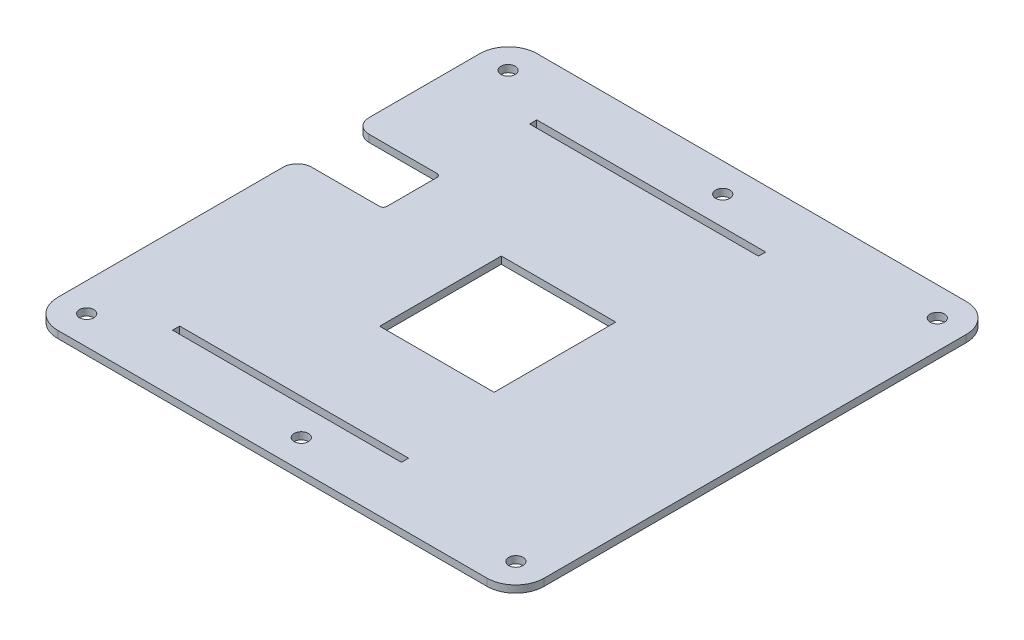
ISO-10303-21;
HEADER;
FILE_DESCRIPTION(('STEP AP214'),'2;1');
FILE_NAME('part.step','',(''),(''),'','','');
FILE_SCHEMA(('AUTOMOTIVE_DESIGN { 1 0 10303 214 1 1 1 1 }'));
ENDSEC;
DATA;
#1=APPLICATION_CONTEXT('core data for automotive mechanical design processes');
#2=APPLICATION_PROTOCOL_DEFINITION('international standard','automotive_design',2000,#1);
#3=PRODUCT_CONTEXT('',#1,'mechanical');
#4=PRODUCT('Part','Part','',(#3));
#5=PRODUCT_RELATED_PRODUCT_CATEGORY('part','',(#4));
#6=PRODUCT_DEFINITION_FORMATION('','',#4);
#7=PRODUCT_DEFINITION_CONTEXT('part definition',#1,'design');
#8=PRODUCT_DEFINITION('design','',#6,#7);
#9=PRODUCT_DEFINITION_SHAPE('','',#8);
#10=(LENGTH_UNIT() NAMED_UNIT(*) SI_UNIT(.MILLI.,.METRE.));
#11=(NAMED_UNIT(*) PLANE_ANGLE_UNIT() SI_UNIT($,.RADIAN.));
#12=(NAMED_UNIT(*) SI_UNIT($,.STERADIAN.) SOLID_ANGLE_UNIT());
#13=UNCERTAINTY_MEASURE_WITH_UNIT(LENGTH_MEASURE(1.E-05),#10,'distance_accuracy_value','');
#14=(GEOMETRIC_REPRESENTATION_CONTEXT(3) GLOBAL_UNCERTAINTY_ASSIGNED_CONTEXT((#13)) GLOBAL_UNIT_ASSIGNED_CONTEXT((#10,
#11,#12)) REPRESENTATION_CONTEXT('',''));
#15=CARTESIAN_POINT('',(0.,0.,0.));
#16=DIRECTION('',(0.,0.,1.));
#17=DIRECTION('',(1.,0.,0.));
#18=AXIS2_PLACEMENT_3D('',#15,#16,#17);
#19=CARTESIAN_POINT('',(0.,3.175,0.));
#20=DIRECTION('',(0.,1.,0.));
#21=DIRECTION('',(0.,0.,1.));
#22=AXIS2_PLACEMENT_3D('',#19,#20,#21);
#23=PLANE('',#22);
#24=CARTESIAN_POINT('',(19.05,3.175,-93.5354999999989));
#25=DIRECTION('',(0.,1.,0.));
#26=DIRECTION('',(0.,0.,1.));
#27=AXIS2_PLACEMENT_3D('',#24,#25,#26);
#28=CIRCLE('',#27,3.175);
#29=CARTESIAN_POINT('',(19.05,3.175,-90.3604999999989));
#30=VERTEX_POINT('',#29);
#31=EDGE_CURVE('E445',#30,#30,#28,.T.);
#32=ORIENTED_EDGE('',*,*,#31,.F.);
#33=EDGE_LOOP('',(#32));
#34=FACE_BOUND('',#33,.T.);
#35=CARTESIAN_POINT('',(-76.2,3.175,-93.5354999999989));
#36=DIRECTION('',(0.,1.,0.));
#37=DIRECTION('',(0.,0.,1.));
#38=AXIS2_PLACEMENT_3D('',#35,#36,#37);
#39=CIRCLE('',#38,3.175);
#40=CARTESIAN_POINT('',(-76.2,3.175,-90.3604999999989));
#41=VERTEX_POINT('',#40);
#42=EDGE_CURVE('E448',#41,#41,#39,.T.);
#43=ORIENTED_EDGE('',*,*,#42,.F.);
#44=EDGE_LOOP('',(#43));
#45=FACE_BOUND('',#44,.T.);
#46=CARTESIAN_POINT('',(-76.2,3.175,93.5354999999989));
#47=DIRECTION('',(0.,1.,0.));
#48=DIRECTION('',(0.,0.,1.));
#49=AXIS2_PLACEMENT_3D('',#46,#47,#48);
#50=CIRCLE('',#49,3.175);
#51=CARTESIAN_POINT('',(-76.2,3.175,96.7104999999989));
#52=VERTEX_POINT('',#51);
#53=EDGE_CURVE('E451',#52,#52,#50,.T.);
#54=ORIENTED_EDGE('',*,*,#53,.F.);
#55=EDGE_LOOP('',(#54));
#56=FACE_BOUND('',#55,.T.);
#57=CARTESIAN_POINT('',(19.05,3.175,93.5354999999989));
#58=DIRECTION('',(0.,1.,0.));
#59=DIRECTION('',(0.,0.,1.));
#60=AXIS2_PLACEMENT_3D('',#57,#58,#59);
#61=CIRCLE('',#60,3.175);
#62=CARTESIAN_POINT('',(19.05,3.175,96.7104999999989));
#63=VERTEX_POINT('',#62);
#64=EDGE_CURVE('E454',#63,#63,#61,.T.);
#65=ORIENTED_EDGE('',*,*,#64,.F.);
#66=EDGE_LOOP('',(#65));
#67=FACE_BOUND('',#66,.T.);
#68=CARTESIAN_POINT('',(114.3,3.175,93.5354999999989));
#69=DIRECTION('',(0.,1.,0.));
#70=DIRECTION('',(0.,0.,1.));
#71=AXIS2_PLACEMENT_3D('',#68,#69,#70);
#72=CIRCLE('',#71,3.175);
#73=CARTESIAN_POINT('',(114.3,3.175,96.7104999999989));
#74=VERTEX_POINT('',#73);
#75=EDGE_CURVE('E457',#74,#74,#72,.T.);
#76=ORIENTED_EDGE('',*,*,#75,.F.);
#77=EDGE_LOOP('',(#76));
#78=FACE_BOUND('',#77,.T.);
#79=CARTESIAN_POINT('',(114.3,3.175,-93.5354999999989));
#80=DIRECTION('',(0.,1.,0.));
#81=DIRECTION('',(0.,0.,1.));
#82=AXIS2_PLACEMENT_3D('',#79,#80,#81);
#83=CIRCLE('',#82,3.175);
#84=CARTESIAN_POINT('',(114.3,3.175,-90.3604999999989));
#85=VERTEX_POINT('',#84);
#86=EDGE_CURVE('E435',#85,#85,#83,.T.);
#87=ORIENTED_EDGE('',*,*,#86,.F.);
#88=EDGE_LOOP('',(#87));
#89=FACE_BOUND('',#88,.T.);
#90=DIRECTION('',(1.,0.,0.));
#91=VECTOR('',#90,1.);
#92=CARTESIAN_POINT('',(-107.95,3.175,-12.7));
#93=LINE('',#92,#91);
#94=CARTESIAN_POINT('',(-82.55,3.175,-12.7));
#95=VERTEX_POINT('',#94);
#96=CARTESIAN_POINT('',(-52.3875,3.175,-12.7));
#97=VERTEX_POINT('',#96);
#98=EDGE_CURVE('E269',#95,#97,#93,.T.);
#99=ORIENTED_EDGE('',*,*,#98,.F.);
#100=CARTESIAN_POINT('',(-82.55,3.175,-6.34999999999999));
#101=DIRECTION('',(0.,1.,0.));
#102=DIRECTION('',(0.,0.,1.));
#103=AXIS2_PLACEMENT_3D('',#100,#101,#102);
#104=CIRCLE('',#103,6.35);
#105=CARTESIAN_POINT('',(-88.9,3.175,-6.34999999999999));
#106=VERTEX_POINT('',#105);
#107=EDGE_CURVE('E424',#95,#106,#104,.T.);
#108=ORIENTED_EDGE('',*,*,#107,.T.);
#109=DIRECTION('',(0.,0.,-1.));
#110=VECTOR('',#109,1.);
#111=CARTESIAN_POINT('',(-88.9,3.175,-106.3625));
#112=LINE('',#111,#110);
#113=CARTESIAN_POINT('',(-88.9,3.175,93.6625));
#114=VERTEX_POINT('',#113);
#115=EDGE_CURVE('E434',#114,#106,#112,.T.);
#116=ORIENTED_EDGE('',*,*,#115,.F.);
#117=CARTESIAN_POINT('',(-76.2,3.175,93.6625));
#118=DIRECTION('',(0.,1.,0.));
#119=DIRECTION('',(0.,0.,1.));
#120=AXIS2_PLACEMENT_3D('',#117,#118,#119);
#121=CIRCLE('',#120,12.7);
#122=CARTESIAN_POINT('',(-76.2,3.175,106.3625));
#123=VERTEX_POINT('',#122);
#124=EDGE_CURVE('E367',#114,#123,#121,.T.);
#125=ORIENTED_EDGE('',*,*,#124,.T.);
#126=DIRECTION('',(1.,0.,0.));
#127=VECTOR('',#126,1.);
#128=CARTESIAN_POINT('',(-127.,3.175,106.3625));
#129=LINE('',#128,#127);
#130=CARTESIAN_POINT('',(114.3,3.175,106.3625));
#131=VERTEX_POINT('',#130);
#132=EDGE_CURVE('E347',#123,#131,#129,.T.);
#133=ORIENTED_EDGE('',*,*,#132,.T.);
#134=CARTESIAN_POINT('',(114.3,3.175,93.6625));
#135=DIRECTION('',(0.,1.,0.));
#136=DIRECTION('',(0.,0.,1.));
#137=AXIS2_PLACEMENT_3D('',#134,#135,#136);
#138=CIRCLE('',#137,12.7);
#139=CARTESIAN_POINT('',(127.,3.175,93.6625));
#140=VERTEX_POINT('',#139);
#141=EDGE_CURVE('E363',#131,#140,#138,.T.);
#142=ORIENTED_EDGE('',*,*,#141,.T.);
#143=DIRECTION('',(0.,0.,-1.));
#144=VECTOR('',#143,1.);
#145=CARTESIAN_POINT('',(127.,3.175,-106.3625));
#146=LINE('',#145,#144);
#147=CARTESIAN_POINT('',(127.,3.175,-93.6625));
#148=VERTEX_POINT('',#147);
#149=EDGE_CURVE('E340',#140,#148,#146,.T.);
#150=ORIENTED_EDGE('',*,*,#149,.T.);
#151=CARTESIAN_POINT('',(114.3,3.175,-93.6625));
#152=DIRECTION('',(0.,1.,0.));
#153=DIRECTION('',(0.,0.,1.));
#154=AXIS2_PLACEMENT_3D('',#151,#152,#153);
#155=CIRCLE('',#154,12.7);
#156=CARTESIAN_POINT('',(114.3,3.175,-106.3625));
#157=VERTEX_POINT('',#156);
#158=EDGE_CURVE('E365',#148,#157,#155,.T.);
#159=ORIENTED_EDGE('',*,*,#158,.T.);
#160=DIRECTION('',(-1.,0.,0.));
#161=VECTOR('',#160,1.);
#162=CARTESIAN_POINT('',(-127.,3.175,-106.3625));
#163=LINE('',#162,#161);
#164=CARTESIAN_POINT('',(-76.2,3.175,-106.3625));
#165=VERTEX_POINT('',#164);
#166=EDGE_CURVE('E343',#157,#165,#163,.T.);
#167=ORIENTED_EDGE('',*,*,#166,.T.);
#168=CARTESIAN_POINT('',(-76.2,3.175,-93.6625));
#169=DIRECTION('',(0.,1.,0.));
#170=DIRECTION('',(0.,0.,1.));
#171=AXIS2_PLACEMENT_3D('',#168,#169,#170);
#172=CIRCLE('',#171,12.7);
#173=CARTESIAN_POINT('',(-88.9,3.175,-93.6625));
#174=VERTEX_POINT('',#173);
#175=EDGE_CURVE('E369',#165,#174,#172,.T.);
#176=ORIENTED_EDGE('',*,*,#175,.T.);
#177=CARTESIAN_POINT('',(-88.9,3.175,-44.45));
#178=VERTEX_POINT('',#177);
#179=EDGE_CURVE('E428',#178,#174,#112,.T.);
#180=ORIENTED_EDGE('',*,*,#179,.F.);
#181=CARTESIAN_POINT('',(-82.55,3.175,-44.45));
#182=DIRECTION('',(0.,1.,0.));
#183=DIRECTION('',(0.,0.,1.));
#184=AXIS2_PLACEMENT_3D('',#181,#182,#183);
#185=CIRCLE('',#184,6.35);
#186=CARTESIAN_POINT('',(-82.55,3.175,-38.1));
#187=VERTEX_POINT('',#186);
#188=EDGE_CURVE('E49',#178,#187,#185,.T.);
#189=ORIENTED_EDGE('',*,*,#188,.T.);
#190=DIRECTION('',(-1.,0.,0.));
#191=VECTOR('',#190,1.);
#192=CARTESIAN_POINT('',(-107.95,3.175,-38.1));
#193=LINE('',#192,#191);
#194=CARTESIAN_POINT('',(-52.3875,3.175,-38.1));
#195=VERTEX_POINT('',#194);
#196=EDGE_CURVE('E266',#195,#187,#193,.T.);
#197=ORIENTED_EDGE('',*,*,#196,.F.);
#198=CARTESIAN_POINT('',(-52.3875,3.175,-36.5125));
#199=DIRECTION('',(0.,1.,0.));
#200=DIRECTION('',(0.,0.,1.));
#201=AXIS2_PLACEMENT_3D('',#198,#199,#200);
#202=CIRCLE('',#201,1.5875);
#203=CARTESIAN_POINT('',(-50.8,3.175,-36.5125));
#204=VERTEX_POINT('',#203);
#205=EDGE_CURVE('E412',#195,#204,#202,.F.);
#206=ORIENTED_EDGE('',*,*,#205,.T.);
#207=DIRECTION('',(0.,0.,-1.));
#208=VECTOR('',#207,1.);
#209=CARTESIAN_POINT('',(-50.8,3.175,-12.7));
#210=LINE('',#209,#208);
#211=CARTESIAN_POINT('',(-50.8,3.175,-14.2875));
#212=VERTEX_POINT('',#211);
#213=EDGE_CURVE('E263',#212,#204,#210,.T.);
#214=ORIENTED_EDGE('',*,*,#213,.F.);
#215=CARTESIAN_POINT('',(-52.3875,3.175,-14.2875));
#216=DIRECTION('',(0.,1.,0.));
#217=DIRECTION('',(0.,0.,1.));
#218=AXIS2_PLACEMENT_3D('',#215,#216,#217);
#219=CIRCLE('',#218,1.5875);
#220=EDGE_CURVE('E407',#212,#97,#219,.F.);
#221=ORIENTED_EDGE('',*,*,#220,.T.);
#222=EDGE_LOOP('',(#99,#108,#116,#125,#133,#142,#150,#159,#167,#176,#180,#189,#197,#206,#214,#221));
#223=FACE_BOUND('',#222,.T.);
#224=DIRECTION('',(1.,0.,0.));
#225=VECTOR('',#224,1.);
#226=CARTESIAN_POINT('',(-50.8,3.175,-77.6604999999989));
#227=LINE('',#226,#225);
#228=CARTESIAN_POINT('',(-50.8,3.175,-77.6604999999989));
#229=VERTEX_POINT('',#228);
#230=CARTESIAN_POINT('',(50.8,3.175,-77.6604999999989));
#231=VERTEX_POINT('',#230);
#232=EDGE_CURVE('E311',#229,#231,#227,.T.);
#233=ORIENTED_EDGE('',*,*,#232,.F.);
#234=DIRECTION('',(0.,0.,1.));
#235=VECTOR('',#234,1.);
#236=CARTESIAN_POINT('',(-50.8,3.175,-80.8354999999989));
#237=LINE('',#236,#235);
#238=CARTESIAN_POINT('',(-50.8,3.175,-80.8354999999989));
#239=VERTEX_POINT('',#238);
#240=EDGE_CURVE('E309',#239,#229,#237,.T.);
#241=ORIENTED_EDGE('',*,*,#240,.F.);
#242=DIRECTION('',(-1.,0.,0.));
#243=VECTOR('',#242,1.);
#244=CARTESIAN_POINT('',(-50.8,3.175,-80.8354999999989));
#245=LINE('',#244,#243);
#246=CARTESIAN_POINT('',(50.8,3.175,-80.8354999999989));
#247=VERTEX_POINT('',#246);
#248=EDGE_CURVE('E317',#247,#239,#245,.T.);
#249=ORIENTED_EDGE('',*,*,#248,.F.);
#250=DIRECTION('',(0.,0.,-1.));
#251=VECTOR('',#250,1.);
#252=CARTESIAN_POINT('',(50.8,3.175,-80.8354999999989));
#253=LINE('',#252,#251);
#254=EDGE_CURVE('E314',#231,#247,#253,.T.);
#255=ORIENTED_EDGE('',*,*,#254,.F.);
#256=EDGE_LOOP('',(#233,#241,#249,#255));
#257=FACE_BOUND('',#256,.T.);
#258=DIRECTION('',(1.,0.,0.));
#259=VECTOR('',#258,1.);
#260=CARTESIAN_POINT('',(-50.8,3.175,80.8354999999989));
#261=LINE('',#260,#259);
#262=CARTESIAN_POINT('',(-50.8,3.175,80.8354999999989));
#263=VERTEX_POINT('',#262);
#264=CARTESIAN_POINT('',(50.8,3.175,80.8354999999989));
#265=VERTEX_POINT('',#264);
#266=EDGE_CURVE('E280',#263,#265,#261,.T.);
#267=ORIENTED_EDGE('',*,*,#266,.F.);
#268=DIRECTION('',(0.,0.,1.));
#269=VECTOR('',#268,1.);
#270=CARTESIAN_POINT('',(-50.8,3.175,77.6604999999989));
#271=LINE('',#270,#269);
#272=CARTESIAN_POINT('',(-50.8,3.175,77.6604999999989));
#273=VERTEX_POINT('',#272);
#274=EDGE_CURVE('E278',#273,#263,#271,.T.);
#275=ORIENTED_EDGE('',*,*,#274,.F.);
#276=DIRECTION('',(-1.,0.,0.));
#277=VECTOR('',#276,1.);
#278=CARTESIAN_POINT('',(-50.8,3.175,77.6604999999989));
#279=LINE('',#278,#277);
#280=CARTESIAN_POINT('',(50.8,3.175,77.6604999999989));
#281=VERTEX_POINT('',#280);
#282=EDGE_CURVE('E286',#281,#273,#279,.T.);
#283=ORIENTED_EDGE('',*,*,#282,.F.);
#284=DIRECTION('',(0.,0.,-1.));
#285=VECTOR('',#284,1.);
#286=CARTESIAN_POINT('',(50.8,3.175,77.6604999999989));
#287=LINE('',#286,#285);
#288=EDGE_CURVE('E283',#265,#281,#287,.T.);
#289=ORIENTED_EDGE('',*,*,#288,.F.);
#290=EDGE_LOOP('',(#267,#275,#283,#289));
#291=FACE_BOUND('',#290,.T.);
#292=DIRECTION('',(1.,0.,0.));
#293=VECTOR('',#292,1.);
#294=CARTESIAN_POINT('',(44.45,3.175,33.3375));
#295=LINE('',#294,#293);
#296=CARTESIAN_POINT('',(-6.35,3.175,33.3375));
#297=VERTEX_POINT('',#296);
#298=CARTESIAN_POINT('',(44.45,3.175,33.3375));
#299=VERTEX_POINT('',#298);
#300=EDGE_CURVE('E230',#297,#299,#295,.T.);
#301=ORIENTED_EDGE('',*,*,#300,.F.);
#302=DIRECTION('',(0.,0.,1.));
#303=VECTOR('',#302,1.);
#304=CARTESIAN_POINT('',(-6.35000000000001,3.175,-20.6375));
#305=LINE('',#304,#303);
#306=CARTESIAN_POINT('',(-6.35000000000001,3.175,-20.6375));
#307=VERTEX_POINT('',#306);
#308=EDGE_CURVE('E220',#307,#297,#305,.T.);
#309=ORIENTED_EDGE('',*,*,#308,.F.);
#310=DIRECTION('',(-1.,0.,0.));
#311=VECTOR('',#310,1.);
#312=CARTESIAN_POINT('',(44.45,3.175,-20.6375));
#313=LINE('',#312,#311);
#314=CARTESIAN_POINT('',(44.45,3.175,-20.6375));
#315=VERTEX_POINT('',#314);
#316=EDGE_CURVE('E245',#315,#307,#313,.T.);
#317=ORIENTED_EDGE('',*,*,#316,.F.);
#318=DIRECTION('',(0.,0.,-1.));
#319=VECTOR('',#318,1.);
#320=CARTESIAN_POINT('',(44.45,3.175,-20.6375));
#321=LINE('',#320,#319);
#322=EDGE_CURVE('E243',#299,#315,#321,.T.);
#323=ORIENTED_EDGE('',*,*,#322,.F.);
#324=EDGE_LOOP('',(#301,#309,#317,#323));
#325=FACE_BOUND('',#324,.T.);
#326=ADVANCED_FACE('F34',(#34,#45,#56,#67,#78,#89,#223,#257,#291,#325),#23,.T.);
#327=CARTESIAN_POINT('',(0.,0.,0.));
#328=DIRECTION('',(0.,1.,0.));
#329=DIRECTION('',(0.,0.,1.));
#330=AXIS2_PLACEMENT_3D('',#327,#328,#329);
#331=PLANE('',#330);
#332=CARTESIAN_POINT('',(19.05,0.,-93.5354999999989));
#333=DIRECTION('',(0.,1.,0.));
#334=DIRECTION('',(0.,0.,1.));
#335=AXIS2_PLACEMENT_3D('',#332,#333,#334);
#336=CIRCLE('',#335,3.175);
#337=CARTESIAN_POINT('',(19.05,0.,-90.3604999999989));
#338=VERTEX_POINT('',#337);
#339=EDGE_CURVE('E467',#338,#338,#336,.T.);
#340=ORIENTED_EDGE('',*,*,#339,.T.);
#341=EDGE_LOOP('',(#340));
#342=FACE_BOUND('',#341,.T.);
#343=CARTESIAN_POINT('',(-76.2,0.,-93.5354999999989));
#344=DIRECTION('',(0.,1.,0.));
#345=DIRECTION('',(0.,0.,1.));
#346=AXIS2_PLACEMENT_3D('',#343,#344,#345);
#347=CIRCLE('',#346,3.175);
#348=CARTESIAN_POINT('',(-76.2,0.,-90.3604999999989));
#349=VERTEX_POINT('',#348);
#350=EDGE_CURVE('E470',#349,#349,#347,.T.);
#351=ORIENTED_EDGE('',*,*,#350,.T.);
#352=EDGE_LOOP('',(#351));
#353=FACE_BOUND('',#352,.T.);
#354=CARTESIAN_POINT('',(-76.2,0.,93.5354999999989));
#355=DIRECTION('',(0.,1.,0.));
#356=DIRECTION('',(0.,0.,1.));
#357=AXIS2_PLACEMENT_3D('',#354,#355,#356);
#358=CIRCLE('',#357,3.175);
#359=CARTESIAN_POINT('',(-76.2,0.,96.7104999999989));
#360=VERTEX_POINT('',#359);
#361=EDGE_CURVE('E464',#360,#360,#358,.T.);
#362=ORIENTED_EDGE('',*,*,#361,.T.);
#363=EDGE_LOOP('',(#362));
#364=FACE_BOUND('',#363,.T.);
#365=CARTESIAN_POINT('',(19.05,0.,93.5354999999989));
#366=DIRECTION('',(0.,1.,0.));
#367=DIRECTION('',(0.,0.,1.));
#368=AXIS2_PLACEMENT_3D('',#365,#366,#367);
#369=CIRCLE('',#368,3.175);
#370=CARTESIAN_POINT('',(19.05,0.,96.7104999999989));
#371=VERTEX_POINT('',#370);
#372=EDGE_CURVE('E461',#371,#371,#369,.T.);
#373=ORIENTED_EDGE('',*,*,#372,.T.);
#374=EDGE_LOOP('',(#373));
#375=FACE_BOUND('',#374,.T.);
#376=CARTESIAN_POINT('',(114.3,0.,93.5354999999989));
#377=DIRECTION('',(0.,1.,0.));
#378=DIRECTION('',(0.,0.,1.));
#379=AXIS2_PLACEMENT_3D('',#376,#377,#378);
#380=CIRCLE('',#379,3.175);
#381=CARTESIAN_POINT('',(114.3,0.,96.7104999999989));
#382=VERTEX_POINT('',#381);
#383=EDGE_CURVE('E460',#382,#382,#380,.T.);
#384=ORIENTED_EDGE('',*,*,#383,.T.);
#385=EDGE_LOOP('',(#384));
#386=FACE_BOUND('',#385,.T.);
#387=CARTESIAN_POINT('',(114.3,0.,-93.5354999999989));
#388=DIRECTION('',(0.,1.,0.));
#389=DIRECTION('',(0.,0.,1.));
#390=AXIS2_PLACEMENT_3D('',#387,#388,#389);
#391=CIRCLE('',#390,3.175);
#392=CARTESIAN_POINT('',(114.3,0.,-90.3604999999989));
#393=VERTEX_POINT('',#392);
#394=EDGE_CURVE('E438',#393,#393,#391,.T.);
#395=ORIENTED_EDGE('',*,*,#394,.T.);
#396=EDGE_LOOP('',(#395));
#397=FACE_BOUND('',#396,.T.);
#398=DIRECTION('',(0.,0.,-1.));
#399=VECTOR('',#398,1.);
#400=CARTESIAN_POINT('',(-88.9,0.,-106.3625));
#401=LINE('',#400,#399);
#402=CARTESIAN_POINT('',(-88.9,0.,93.6625));
#403=VERTEX_POINT('',#402);
#404=CARTESIAN_POINT('',(-88.9,0.,-6.34999999999999));
#405=VERTEX_POINT('',#404);
#406=EDGE_CURVE('E252',#403,#405,#401,.T.);
#407=ORIENTED_EDGE('',*,*,#406,.T.);
#408=CARTESIAN_POINT('',(-82.55,0.,-6.34999999999999));
#409=DIRECTION('',(0.,1.,0.));
#410=DIRECTION('',(0.,0.,1.));
#411=AXIS2_PLACEMENT_3D('',#408,#409,#410);
#412=CIRCLE('',#411,6.35);
#413=CARTESIAN_POINT('',(-82.55,0.,-12.7));
#414=VERTEX_POINT('',#413);
#415=EDGE_CURVE('E419',#405,#414,#412,.F.);
#416=ORIENTED_EDGE('',*,*,#415,.T.);
#417=DIRECTION('',(1.,0.,0.));
#418=VECTOR('',#417,1.);
#419=CARTESIAN_POINT('',(-107.95,0.,-12.7));
#420=LINE('',#419,#418);
#421=CARTESIAN_POINT('',(-52.3875,0.,-12.7));
#422=VERTEX_POINT('',#421);
#423=EDGE_CURVE('E267',#414,#422,#420,.T.);
#424=ORIENTED_EDGE('',*,*,#423,.T.);
#425=CARTESIAN_POINT('',(-52.3875,0.,-14.2875));
#426=DIRECTION('',(0.,1.,0.));
#427=DIRECTION('',(0.,0.,1.));
#428=AXIS2_PLACEMENT_3D('',#425,#426,#427);
#429=CIRCLE('',#428,1.5875);
#430=CARTESIAN_POINT('',(-50.8,0.,-14.2875));
#431=VERTEX_POINT('',#430);
#432=EDGE_CURVE('E405',#422,#431,#429,.T.);
#433=ORIENTED_EDGE('',*,*,#432,.T.);
#434=DIRECTION('',(0.,0.,-1.));
#435=VECTOR('',#434,1.);
#436=CARTESIAN_POINT('',(-50.8,0.,-12.7));
#437=LINE('',#436,#435);
#438=CARTESIAN_POINT('',(-50.8,0.,-36.5125));
#439=VERTEX_POINT('',#438);
#440=EDGE_CURVE('E238',#431,#439,#437,.T.);
#441=ORIENTED_EDGE('',*,*,#440,.T.);
#442=CARTESIAN_POINT('',(-52.3875,0.,-36.5125));
#443=DIRECTION('',(0.,1.,0.));
#444=DIRECTION('',(0.,0.,1.));
#445=AXIS2_PLACEMENT_3D('',#442,#443,#444);
#446=CIRCLE('',#445,1.5875);
#447=CARTESIAN_POINT('',(-52.3875,0.,-38.1));
#448=VERTEX_POINT('',#447);
#449=EDGE_CURVE('E410',#439,#448,#446,.T.);
#450=ORIENTED_EDGE('',*,*,#449,.T.);
#451=DIRECTION('',(-1.,0.,0.));
#452=VECTOR('',#451,1.);
#453=CARTESIAN_POINT('',(-107.95,0.,-38.1));
#454=LINE('',#453,#452);
#455=CARTESIAN_POINT('',(-82.55,0.,-38.1));
#456=VERTEX_POINT('',#455);
#457=EDGE_CURVE('E274',#448,#456,#454,.T.);
#458=ORIENTED_EDGE('',*,*,#457,.T.);
#459=CARTESIAN_POINT('',(-82.55,0.,-44.45));
#460=DIRECTION('',(0.,1.,0.));
#461=DIRECTION('',(0.,0.,1.));
#462=AXIS2_PLACEMENT_3D('',#459,#460,#461);
#463=CIRCLE('',#462,6.35);
#464=CARTESIAN_POINT('',(-88.9,0.,-44.45));
#465=VERTEX_POINT('',#464);
#466=EDGE_CURVE('E417',#456,#465,#463,.F.);
#467=ORIENTED_EDGE('',*,*,#466,.T.);
#468=CARTESIAN_POINT('',(-88.9,0.,-93.6625));
#469=VERTEX_POINT('',#468);
#470=EDGE_CURVE('E429',#465,#469,#401,.T.);
#471=ORIENTED_EDGE('',*,*,#470,.T.);
#472=CARTESIAN_POINT('',(-76.2,0.,-93.6625));
#473=DIRECTION('',(0.,1.,0.));
#474=DIRECTION('',(0.,0.,1.));
#475=AXIS2_PLACEMENT_3D('',#472,#473,#474);
#476=CIRCLE('',#475,12.7);
#477=CARTESIAN_POINT('',(-76.2,0.,-106.3625));
#478=VERTEX_POINT('',#477);
#479=EDGE_CURVE('E381',#469,#478,#476,.F.);
#480=ORIENTED_EDGE('',*,*,#479,.T.);
#481=DIRECTION('',(-1.,0.,0.));
#482=VECTOR('',#481,1.);
#483=CARTESIAN_POINT('',(-127.,0.,-106.3625));
#484=LINE('',#483,#482);
#485=CARTESIAN_POINT('',(114.3,0.,-106.3625));
#486=VERTEX_POINT('',#485);
#487=EDGE_CURVE('E353',#486,#478,#484,.T.);
#488=ORIENTED_EDGE('',*,*,#487,.F.);
#489=CARTESIAN_POINT('',(114.3,0.,-93.6625));
#490=DIRECTION('',(0.,1.,0.));
#491=DIRECTION('',(0.,0.,1.));
#492=AXIS2_PLACEMENT_3D('',#489,#490,#491);
#493=CIRCLE('',#492,12.7);
#494=CARTESIAN_POINT('',(127.,0.,-93.6625));
#495=VERTEX_POINT('',#494);
#496=EDGE_CURVE('E377',#486,#495,#493,.F.);
#497=ORIENTED_EDGE('',*,*,#496,.T.);
#498=DIRECTION('',(0.,0.,-1.));
#499=VECTOR('',#498,1.);
#500=CARTESIAN_POINT('',(127.,0.,-106.3625));
#501=LINE('',#500,#499);
#502=CARTESIAN_POINT('',(127.,0.,93.6625));
#503=VERTEX_POINT('',#502);
#504=EDGE_CURVE('E339',#503,#495,#501,.T.);
#505=ORIENTED_EDGE('',*,*,#504,.F.);
#506=CARTESIAN_POINT('',(114.3,0.,93.6625));
#507=DIRECTION('',(0.,1.,0.));
#508=DIRECTION('',(0.,0.,1.));
#509=AXIS2_PLACEMENT_3D('',#506,#507,#508);
#510=CIRCLE('',#509,12.7);
#511=CARTESIAN_POINT('',(114.3,0.,106.3625));
#512=VERTEX_POINT('',#511);
#513=EDGE_CURVE('E375',#503,#512,#510,.F.);
#514=ORIENTED_EDGE('',*,*,#513,.T.);
#515=DIRECTION('',(1.,0.,0.));
#516=VECTOR('',#515,1.);
#517=CARTESIAN_POINT('',(-127.,0.,106.3625));
#518=LINE('',#517,#516);
#519=CARTESIAN_POINT('',(-76.2,0.,106.3625));
#520=VERTEX_POINT('',#519);
#521=EDGE_CURVE('E344',#520,#512,#518,.T.);
#522=ORIENTED_EDGE('',*,*,#521,.F.);
#523=CARTESIAN_POINT('',(-76.2,0.,93.6625));
#524=DIRECTION('',(0.,1.,0.));
#525=DIRECTION('',(0.,0.,1.));
#526=AXIS2_PLACEMENT_3D('',#523,#524,#525);
#527=CIRCLE('',#526,12.7);
#528=EDGE_CURVE('E379',#520,#403,#527,.F.);
#529=ORIENTED_EDGE('',*,*,#528,.T.);
#530=EDGE_LOOP('',(#407,#416,#424,#433,#441,#450,#458,#467,#471,#480,#488,#497,#505,#514,#522,#529));
#531=FACE_BOUND('',#530,.T.);
#532=DIRECTION('',(0.,0.,1.));
#533=VECTOR('',#532,1.);
#534=CARTESIAN_POINT('',(-50.8,0.,-80.8354999999989));
#535=LINE('',#534,#533);
#536=CARTESIAN_POINT('',(-50.8,0.,-80.8354999999989));
#537=VERTEX_POINT('',#536);
#538=CARTESIAN_POINT('',(-50.8,0.,-77.6604999999989));
#539=VERTEX_POINT('',#538);
#540=EDGE_CURVE('E308',#537,#539,#535,.T.);
#541=ORIENTED_EDGE('',*,*,#540,.T.);
#542=DIRECTION('',(1.,0.,0.));
#543=VECTOR('',#542,1.);
#544=CARTESIAN_POINT('',(-50.8,0.,-77.6604999999989));
#545=LINE('',#544,#543);
#546=CARTESIAN_POINT('',(50.8,0.,-77.6604999999989));
#547=VERTEX_POINT('',#546);
#548=EDGE_CURVE('E322',#539,#547,#545,.T.);
#549=ORIENTED_EDGE('',*,*,#548,.T.);
#550=DIRECTION('',(0.,0.,-1.));
#551=VECTOR('',#550,1.);
#552=CARTESIAN_POINT('',(50.8,0.,-80.8354999999989));
#553=LINE('',#552,#551);
#554=CARTESIAN_POINT('',(50.8,0.,-80.8354999999989));
#555=VERTEX_POINT('',#554);
#556=EDGE_CURVE('E325',#547,#555,#553,.T.);
#557=ORIENTED_EDGE('',*,*,#556,.T.);
#558=DIRECTION('',(-1.,0.,0.));
#559=VECTOR('',#558,1.);
#560=CARTESIAN_POINT('',(-50.8,0.,-80.8354999999989));
#561=LINE('',#560,#559);
#562=EDGE_CURVE('E312',#555,#537,#561,.T.);
#563=ORIENTED_EDGE('',*,*,#562,.T.);
#564=EDGE_LOOP('',(#541,#549,#557,#563));
#565=FACE_BOUND('',#564,.T.);
#566=DIRECTION('',(0.,0.,1.));
#567=VECTOR('',#566,1.);
#568=CARTESIAN_POINT('',(-50.8,0.,77.6604999999989));
#569=LINE('',#568,#567);
#570=CARTESIAN_POINT('',(-50.8,0.,77.6604999999989));
#571=VERTEX_POINT('',#570);
#572=CARTESIAN_POINT('',(-50.8,0.,80.8354999999989));
#573=VERTEX_POINT('',#572);
#574=EDGE_CURVE('E271',#571,#573,#569,.T.);
#575=ORIENTED_EDGE('',*,*,#574,.T.);
#576=DIRECTION('',(1.,0.,0.));
#577=VECTOR('',#576,1.);
#578=CARTESIAN_POINT('',(-50.8,0.,80.8354999999989));
#579=LINE('',#578,#577);
#580=CARTESIAN_POINT('',(50.8,0.,80.8354999999989));
#581=VERTEX_POINT('',#580);
#582=EDGE_CURVE('E291',#573,#581,#579,.T.);
#583=ORIENTED_EDGE('',*,*,#582,.T.);
#584=DIRECTION('',(0.,0.,-1.));
#585=VECTOR('',#584,1.);
#586=CARTESIAN_POINT('',(50.8,0.,77.6604999999989));
#587=LINE('',#586,#585);
#588=CARTESIAN_POINT('',(50.8,0.,77.6604999999989));
#589=VERTEX_POINT('',#588);
#590=EDGE_CURVE('E294',#581,#589,#587,.T.);
#591=ORIENTED_EDGE('',*,*,#590,.T.);
#592=DIRECTION('',(-1.,0.,0.));
#593=VECTOR('',#592,1.);
#594=CARTESIAN_POINT('',(-50.8,0.,77.6604999999989));
#595=LINE('',#594,#593);
#596=EDGE_CURVE('E281',#589,#571,#595,.T.);
#597=ORIENTED_EDGE('',*,*,#596,.T.);
#598=EDGE_LOOP('',(#575,#583,#591,#597));
#599=FACE_BOUND('',#598,.T.);
#600=DIRECTION('',(0.,0.,1.));
#601=VECTOR('',#600,1.);
#602=CARTESIAN_POINT('',(-6.35000000000001,0.,-20.6375));
#603=LINE('',#602,#601);
#604=CARTESIAN_POINT('',(-6.35000000000001,0.,-20.6375));
#605=VERTEX_POINT('',#604);
#606=CARTESIAN_POINT('',(-6.35,0.,33.3375));
#607=VERTEX_POINT('',#606);
#608=EDGE_CURVE('E250',#605,#607,#603,.T.);
#609=ORIENTED_EDGE('',*,*,#608,.T.);
#610=DIRECTION('',(1.,0.,0.));
#611=VECTOR('',#610,1.);
#612=CARTESIAN_POINT('',(44.45,0.,33.3375));
#613=LINE('',#612,#611);
#614=CARTESIAN_POINT('',(44.45,0.,33.3375));
#615=VERTEX_POINT('',#614);
#616=EDGE_CURVE('E237',#607,#615,#613,.T.);
#617=ORIENTED_EDGE('',*,*,#616,.T.);
#618=DIRECTION('',(0.,0.,-1.));
#619=VECTOR('',#618,1.);
#620=CARTESIAN_POINT('',(44.45,0.,-20.6375));
#621=LINE('',#620,#619);
#622=CARTESIAN_POINT('',(44.45,0.,-20.6375));
#623=VERTEX_POINT('',#622);
#624=EDGE_CURVE('E254',#615,#623,#621,.T.);
#625=ORIENTED_EDGE('',*,*,#624,.T.);
#626=DIRECTION('',(-1.,0.,0.));
#627=VECTOR('',#626,1.);
#628=CARTESIAN_POINT('',(44.45,0.,-20.6375));
#629=LINE('',#628,#627);
#630=EDGE_CURVE('E231',#623,#605,#629,.T.);
#631=ORIENTED_EDGE('',*,*,#630,.T.);
#632=EDGE_LOOP('',(#609,#617,#625,#631));
#633=FACE_BOUND('',#632,.T.);
#634=ADVANCED_FACE('F476',(#342,#353,#364,#375,#386,#397,#531,#565,#599,#633),#331,.F.);
#635=CARTESIAN_POINT('',(127.,3.175,-106.3625));
#636=DIRECTION('',(-1.,0.,0.));
#637=DIRECTION('',(0.,0.,1.));
#638=AXIS2_PLACEMENT_3D('',#635,#636,#637);
#639=PLANE('',#638);
#640=ORIENTED_EDGE('',*,*,#504,.T.);
#641=DIRECTION('',(0.,-1.,0.));
#642=VECTOR('',#641,1.);
#643=CARTESIAN_POINT('',(127.,3.175,-93.6625));
#644=LINE('',#643,#642);
#645=EDGE_CURVE('E393',#495,#148,#644,.F.);
#646=ORIENTED_EDGE('',*,*,#645,.T.);
#647=ORIENTED_EDGE('',*,*,#149,.F.);
#648=DIRECTION('',(0.,-1.,0.));
#649=VECTOR('',#648,1.);
#650=CARTESIAN_POINT('',(127.,3.175,93.6625));
#651=LINE('',#650,#649);
#652=EDGE_CURVE('E390',#140,#503,#651,.T.);
#653=ORIENTED_EDGE('',*,*,#652,.T.);
#654=EDGE_LOOP('',(#640,#646,#647,#653));
#655=FACE_BOUND('',#654,.T.);
#656=ADVANCED_FACE('F501',(#655),#639,.F.);
#657=CARTESIAN_POINT('',(-127.,3.175,-106.3625));
#658=DIRECTION('',(0.,0.,1.));
#659=DIRECTION('',(1.,0.,0.));
#660=AXIS2_PLACEMENT_3D('',#657,#658,#659);
#661=PLANE('',#660);
#662=ORIENTED_EDGE('',*,*,#487,.T.);
#663=DIRECTION('',(0.,1.,0.));
#664=VECTOR('',#663,1.);
#665=CARTESIAN_POINT('',(-76.2,3.175,-106.3625));
#666=LINE('',#665,#664);
#667=EDGE_CURVE('E360',#478,#165,#666,.T.);
#668=ORIENTED_EDGE('',*,*,#667,.T.);
#669=ORIENTED_EDGE('',*,*,#166,.F.);
#670=DIRECTION('',(0.,-1.,0.));
#671=VECTOR('',#670,1.);
#672=CARTESIAN_POINT('',(114.3,3.175,-106.3625));
#673=LINE('',#672,#671);
#674=EDGE_CURVE('E350',#157,#486,#673,.T.);
#675=ORIENTED_EDGE('',*,*,#674,.T.);
#676=EDGE_LOOP('',(#662,#668,#669,#675));
#677=FACE_BOUND('',#676,.T.);
#678=ADVANCED_FACE('F513',(#677),#661,.F.);
#679=CARTESIAN_POINT('',(-127.,3.175,106.3625));
#680=DIRECTION('',(0.,0.,-1.));
#681=DIRECTION('',(-1.,0.,0.));
#682=AXIS2_PLACEMENT_3D('',#679,#680,#681);
#683=PLANE('',#682);
#684=ORIENTED_EDGE('',*,*,#132,.F.);
#685=DIRECTION('',(0.,1.,0.));
#686=VECTOR('',#685,1.);
#687=CARTESIAN_POINT('',(-76.2,3.175,106.3625));
#688=LINE('',#687,#686);
#689=EDGE_CURVE('E388',#123,#520,#688,.F.);
#690=ORIENTED_EDGE('',*,*,#689,.T.);
#691=ORIENTED_EDGE('',*,*,#521,.T.);
#692=DIRECTION('',(0.,-1.,0.));
#693=VECTOR('',#692,1.);
#694=CARTESIAN_POINT('',(114.3,3.175,106.3625));
#695=LINE('',#694,#693);
#696=EDGE_CURVE('E386',#512,#131,#695,.F.);
#697=ORIENTED_EDGE('',*,*,#696,.T.);
#698=EDGE_LOOP('',(#684,#690,#691,#697));
#699=FACE_BOUND('',#698,.T.);
#700=ADVANCED_FACE('F510',(#699),#683,.F.);
#701=CARTESIAN_POINT('',(-50.8,3.175,-80.8354999999989));
#702=DIRECTION('',(1.,0.,0.));
#703=DIRECTION('',(0.,0.,-1.));
#704=AXIS2_PLACEMENT_3D('',#701,#702,#703);
#705=PLANE('',#704);
#706=ORIENTED_EDGE('',*,*,#540,.F.);
#707=DIRECTION('',(0.,-1.,0.));
#708=VECTOR('',#707,1.);
#709=CARTESIAN_POINT('',(-50.8,3.175,-80.8354999999989));
#710=LINE('',#709,#708);
#711=EDGE_CURVE('E319',#239,#537,#710,.T.);
#712=ORIENTED_EDGE('',*,*,#711,.F.);
#713=ORIENTED_EDGE('',*,*,#240,.T.);
#714=DIRECTION('',(0.,-1.,0.));
#715=VECTOR('',#714,1.);
#716=CARTESIAN_POINT('',(-50.8,3.175,-77.6604999999989));
#717=LINE('',#716,#715);
#718=EDGE_CURVE('E336',#229,#539,#717,.T.);
#719=ORIENTED_EDGE('',*,*,#718,.T.);
#720=EDGE_LOOP('',(#706,#712,#713,#719));
#721=FACE_BOUND('',#720,.T.);
#722=ADVANCED_FACE('F507',(#721),#705,.T.);
#723=CARTESIAN_POINT('',(-50.8,3.175,-77.6604999999989));
#724=DIRECTION('',(0.,0.,-1.));
#725=DIRECTION('',(-1.,0.,0.));
#726=AXIS2_PLACEMENT_3D('',#723,#724,#725);
#727=PLANE('',#726);
#728=ORIENTED_EDGE('',*,*,#548,.F.);
#729=ORIENTED_EDGE('',*,*,#718,.F.);
#730=ORIENTED_EDGE('',*,*,#232,.T.);
#731=DIRECTION('',(0.,-1.,0.));
#732=VECTOR('',#731,1.);
#733=CARTESIAN_POINT('',(50.8,3.175,-77.6604999999989));
#734=LINE('',#733,#732);
#735=EDGE_CURVE('E334',#231,#547,#734,.T.);
#736=ORIENTED_EDGE('',*,*,#735,.T.);
#737=EDGE_LOOP('',(#728,#729,#730,#736));
#738=FACE_BOUND('',#737,.T.);
#739=ADVANCED_FACE('F628',(#738),#727,.T.);
#740=CARTESIAN_POINT('',(50.8,3.175,-80.8354999999989));
#741=DIRECTION('',(-1.,0.,0.));
#742=DIRECTION('',(0.,0.,1.));
#743=AXIS2_PLACEMENT_3D('',#740,#741,#742);
#744=PLANE('',#743);
#745=ORIENTED_EDGE('',*,*,#556,.F.);
#746=ORIENTED_EDGE('',*,*,#735,.F.);
#747=ORIENTED_EDGE('',*,*,#254,.T.);
#748=DIRECTION('',(0.,-1.,0.));
#749=VECTOR('',#748,1.);
#750=CARTESIAN_POINT('',(50.8,3.175,-80.8354999999989));
#751=LINE('',#750,#749);
#752=EDGE_CURVE('E332',#247,#555,#751,.T.);
#753=ORIENTED_EDGE('',*,*,#752,.T.);
#754=EDGE_LOOP('',(#745,#746,#747,#753));
#755=FACE_BOUND('',#754,.T.);
#756=ADVANCED_FACE('F625',(#755),#744,.T.);
#757=CARTESIAN_POINT('',(-50.8,3.175,-80.8354999999989));
#758=DIRECTION('',(0.,0.,1.));
#759=DIRECTION('',(1.,0.,0.));
#760=AXIS2_PLACEMENT_3D('',#757,#758,#759);
#761=PLANE('',#760);
#762=ORIENTED_EDGE('',*,*,#562,.F.);
#763=ORIENTED_EDGE('',*,*,#752,.F.);
#764=ORIENTED_EDGE('',*,*,#248,.T.);
#765=ORIENTED_EDGE('',*,*,#711,.T.);
#766=EDGE_LOOP('',(#762,#763,#764,#765));
#767=FACE_BOUND('',#766,.T.);
#768=ADVANCED_FACE('F621',(#767),#761,.T.);
#769=CARTESIAN_POINT('',(-50.8,3.175,77.6604999999989));
#770=DIRECTION('',(1.,0.,0.));
#771=DIRECTION('',(0.,0.,-1.));
#772=AXIS2_PLACEMENT_3D('',#769,#770,#771);
#773=PLANE('',#772);
#774=ORIENTED_EDGE('',*,*,#574,.F.);
#775=DIRECTION('',(0.,-1.,0.));
#776=VECTOR('',#775,1.);
#777=CARTESIAN_POINT('',(-50.8,3.175,77.6604999999989));
#778=LINE('',#777,#776);
#779=EDGE_CURVE('E288',#273,#571,#778,.T.);
#780=ORIENTED_EDGE('',*,*,#779,.F.);
#781=ORIENTED_EDGE('',*,*,#274,.T.);
#782=DIRECTION('',(0.,-1.,0.));
#783=VECTOR('',#782,1.);
#784=CARTESIAN_POINT('',(-50.8,3.175,80.8354999999989));
#785=LINE('',#784,#783);
#786=EDGE_CURVE('E305',#263,#573,#785,.T.);
#787=ORIENTED_EDGE('',*,*,#786,.T.);
#788=EDGE_LOOP('',(#774,#780,#781,#787));
#789=FACE_BOUND('',#788,.T.);
#790=ADVANCED_FACE('F617',(#789),#773,.T.);
#791=CARTESIAN_POINT('',(-50.8,3.175,80.8354999999989));
#792=DIRECTION('',(0.,0.,-1.));
#793=DIRECTION('',(-1.,0.,0.));
#794=AXIS2_PLACEMENT_3D('',#791,#792,#793);
#795=PLANE('',#794);
#796=ORIENTED_EDGE('',*,*,#582,.F.);
#797=ORIENTED_EDGE('',*,*,#786,.F.);
#798=ORIENTED_EDGE('',*,*,#266,.T.);
#799=DIRECTION('',(0.,-1.,0.));
#800=VECTOR('',#799,1.);
#801=CARTESIAN_POINT('',(50.8,3.175,80.8354999999989));
#802=LINE('',#801,#800);
#803=EDGE_CURVE('E303',#265,#581,#802,.T.);
#804=ORIENTED_EDGE('',*,*,#803,.T.);
#805=EDGE_LOOP('',(#796,#797,#798,#804));
#806=FACE_BOUND('',#805,.T.);
#807=ADVANCED_FACE('F613',(#806),#795,.T.);
#808=CARTESIAN_POINT('',(50.8,3.175,77.6604999999989));
#809=DIRECTION('',(-1.,0.,0.));
#810=DIRECTION('',(0.,0.,1.));
#811=AXIS2_PLACEMENT_3D('',#808,#809,#810);
#812=PLANE('',#811);
#813=ORIENTED_EDGE('',*,*,#590,.F.);
#814=ORIENTED_EDGE('',*,*,#803,.F.);
#815=ORIENTED_EDGE('',*,*,#288,.T.);
#816=DIRECTION('',(0.,-1.,0.));
#817=VECTOR('',#816,1.);
#818=CARTESIAN_POINT('',(50.8,3.175,77.6604999999989));
#819=LINE('',#818,#817);
#820=EDGE_CURVE('E301',#281,#589,#819,.T.);
#821=ORIENTED_EDGE('',*,*,#820,.T.);
#822=EDGE_LOOP('',(#813,#814,#815,#821));
#823=FACE_BOUND('',#822,.T.);
#824=ADVANCED_FACE('F609',(#823),#812,.T.);
#825=CARTESIAN_POINT('',(-50.8,3.175,77.6604999999989));
#826=DIRECTION('',(0.,0.,1.));
#827=DIRECTION('',(1.,0.,0.));
#828=AXIS2_PLACEMENT_3D('',#825,#826,#827);
#829=PLANE('',#828);
#830=ORIENTED_EDGE('',*,*,#596,.F.);
#831=ORIENTED_EDGE('',*,*,#820,.F.);
#832=ORIENTED_EDGE('',*,*,#282,.T.);
#833=ORIENTED_EDGE('',*,*,#779,.T.);
#834=EDGE_LOOP('',(#830,#831,#832,#833));
#835=FACE_BOUND('',#834,.T.);
#836=ADVANCED_FACE('F606',(#835),#829,.T.);
#837=CARTESIAN_POINT('',(-50.8,3.175,-12.7));
#838=DIRECTION('',(-1.,0.,0.));
#839=DIRECTION('',(0.,0.,1.));
#840=AXIS2_PLACEMENT_3D('',#837,#838,#839);
#841=PLANE('',#840);
#842=ORIENTED_EDGE('',*,*,#440,.F.);
#843=DIRECTION('',(0.,-1.,0.));
#844=VECTOR('',#843,1.);
#845=CARTESIAN_POINT('',(-50.8,3.175,-14.2875));
#846=LINE('',#845,#844);
#847=EDGE_CURVE('E401',#431,#212,#846,.F.);
#848=ORIENTED_EDGE('',*,*,#847,.T.);
#849=ORIENTED_EDGE('',*,*,#213,.T.);
#850=DIRECTION('',(0.,-1.,0.));
#851=VECTOR('',#850,1.);
#852=CARTESIAN_POINT('',(-50.8,0.,-36.5125));
#853=LINE('',#852,#851);
#854=EDGE_CURVE('E398',#204,#439,#853,.T.);
#855=ORIENTED_EDGE('',*,*,#854,.T.);
#856=EDGE_LOOP('',(#842,#848,#849,#855));
#857=FACE_BOUND('',#856,.T.);
#858=ADVANCED_FACE('F586',(#857),#841,.T.);
#859=CARTESIAN_POINT('',(-107.95,3.175,-38.1));
#860=DIRECTION('',(0.,0.,1.));
#861=DIRECTION('',(1.,0.,0.));
#862=AXIS2_PLACEMENT_3D('',#859,#860,#861);
#863=PLANE('',#862);
#864=ORIENTED_EDGE('',*,*,#196,.T.);
#865=DIRECTION('',(0.,1.,0.));
#866=VECTOR('',#865,1.);
#867=CARTESIAN_POINT('',(-82.55,0.,-38.1));
#868=LINE('',#867,#866);
#869=EDGE_CURVE('E12',#187,#456,#868,.F.);
#870=ORIENTED_EDGE('',*,*,#869,.T.);
#871=ORIENTED_EDGE('',*,*,#457,.F.);
#872=DIRECTION('',(0.,-1.,0.));
#873=VECTOR('',#872,1.);
#874=CARTESIAN_POINT('',(-52.3875,3.175,-38.1));
#875=LINE('',#874,#873);
#876=EDGE_CURVE('E403',#448,#195,#875,.F.);
#877=ORIENTED_EDGE('',*,*,#876,.T.);
#878=EDGE_LOOP('',(#864,#870,#871,#877));
#879=FACE_BOUND('',#878,.T.);
#880=ADVANCED_FACE('F579',(#879),#863,.T.);
#881=CARTESIAN_POINT('',(-107.95,3.175,-12.7));
#882=DIRECTION('',(0.,0.,-1.));
#883=DIRECTION('',(-1.,0.,0.));
#884=AXIS2_PLACEMENT_3D('',#881,#882,#883);
#885=PLANE('',#884);
#886=ORIENTED_EDGE('',*,*,#423,.F.);
#887=DIRECTION('',(0.,-1.,0.));
#888=VECTOR('',#887,1.);
#889=CARTESIAN_POINT('',(-82.55,3.175,-12.7));
#890=LINE('',#889,#888);
#891=EDGE_CURVE('E421',#414,#95,#890,.F.);
#892=ORIENTED_EDGE('',*,*,#891,.T.);
#893=ORIENTED_EDGE('',*,*,#98,.T.);
#894=DIRECTION('',(0.,-1.,0.));
#895=VECTOR('',#894,1.);
#896=CARTESIAN_POINT('',(-52.3875,0.,-12.7));
#897=LINE('',#896,#895);
#898=EDGE_CURVE('E395',#97,#422,#897,.T.);
#899=ORIENTED_EDGE('',*,*,#898,.T.);
#900=EDGE_LOOP('',(#886,#892,#893,#899));
#901=FACE_BOUND('',#900,.T.);
#902=ADVANCED_FACE('F593',(#901),#885,.T.);
#903=CARTESIAN_POINT('',(-6.35000000000001,3.175,-20.6375));
#904=DIRECTION('',(1.,0.,0.));
#905=DIRECTION('',(0.,0.,-1.));
#906=AXIS2_PLACEMENT_3D('',#903,#904,#905);
#907=PLANE('',#906);
#908=ORIENTED_EDGE('',*,*,#608,.F.);
#909=DIRECTION('',(0.,-1.,0.));
#910=VECTOR('',#909,1.);
#911=CARTESIAN_POINT('',(-6.35000000000001,3.175,-20.6375));
#912=LINE('',#911,#910);
#913=EDGE_CURVE('E226',#307,#605,#912,.T.);
#914=ORIENTED_EDGE('',*,*,#913,.F.);
#915=ORIENTED_EDGE('',*,*,#308,.T.);
#916=DIRECTION('',(0.,-1.,0.));
#917=VECTOR('',#916,1.);
#918=CARTESIAN_POINT('',(-6.35,3.175,33.3375));
#919=LINE('',#918,#917);
#920=EDGE_CURVE('E223',#297,#607,#919,.T.);
#921=ORIENTED_EDGE('',*,*,#920,.T.);
#922=EDGE_LOOP('',(#908,#914,#915,#921));
#923=FACE_BOUND('',#922,.T.);
#924=ADVANCED_FACE('F222',(#923),#907,.T.);
#925=CARTESIAN_POINT('',(44.45,3.175,33.3375));
#926=DIRECTION('',(0.,0.,-1.));
#927=DIRECTION('',(-1.,0.,0.));
#928=AXIS2_PLACEMENT_3D('',#925,#926,#927);
#929=PLANE('',#928);
#930=ORIENTED_EDGE('',*,*,#616,.F.);
#931=ORIENTED_EDGE('',*,*,#920,.F.);
#932=ORIENTED_EDGE('',*,*,#300,.T.);
#933=DIRECTION('',(0.,-1.,0.));
#934=VECTOR('',#933,1.);
#935=CARTESIAN_POINT('',(44.45,3.175,33.3375));
#936=LINE('',#935,#934);
#937=EDGE_CURVE('E239',#299,#615,#936,.T.);
#938=ORIENTED_EDGE('',*,*,#937,.T.);
#939=EDGE_LOOP('',(#930,#931,#932,#938));
#940=FACE_BOUND('',#939,.T.);
#941=ADVANCED_FACE('F234',(#940),#929,.T.);
#942=CARTESIAN_POINT('',(44.45,3.175,-20.6375));
#943=DIRECTION('',(-1.,0.,0.));
#944=DIRECTION('',(0.,0.,1.));
#945=AXIS2_PLACEMENT_3D('',#942,#943,#944);
#946=PLANE('',#945);
#947=ORIENTED_EDGE('',*,*,#624,.F.);
#948=ORIENTED_EDGE('',*,*,#937,.F.);
#949=ORIENTED_EDGE('',*,*,#322,.T.);
#950=DIRECTION('',(0.,-1.,0.));
#951=VECTOR('',#950,1.);
#952=CARTESIAN_POINT('',(44.45,3.175,-20.6375));
#953=LINE('',#952,#951);
#954=EDGE_CURVE('E260',#315,#623,#953,.T.);
#955=ORIENTED_EDGE('',*,*,#954,.T.);
#956=EDGE_LOOP('',(#947,#948,#949,#955));
#957=FACE_BOUND('',#956,.T.);
#958=ADVANCED_FACE('F662',(#957),#946,.T.);
#959=CARTESIAN_POINT('',(44.45,3.175,-20.6375));
#960=DIRECTION('',(0.,0.,1.));
#961=DIRECTION('',(1.,0.,0.));
#962=AXIS2_PLACEMENT_3D('',#959,#960,#961);
#963=PLANE('',#962);
#964=ORIENTED_EDGE('',*,*,#630,.F.);
#965=ORIENTED_EDGE('',*,*,#954,.F.);
#966=ORIENTED_EDGE('',*,*,#316,.T.);
#967=ORIENTED_EDGE('',*,*,#913,.T.);
#968=EDGE_LOOP('',(#964,#965,#966,#967));
#969=FACE_BOUND('',#968,.T.);
#970=ADVANCED_FACE('F659',(#969),#963,.T.);
#971=CARTESIAN_POINT('',(-88.9,0.,-106.3625));
#972=DIRECTION('',(1.,0.,0.));
#973=DIRECTION('',(0.,0.,-1.));
#974=AXIS2_PLACEMENT_3D('',#971,#972,#973);
#975=PLANE('',#974);
#976=ORIENTED_EDGE('',*,*,#115,.T.);
#977=DIRECTION('',(0.,-1.,0.));
#978=VECTOR('',#977,1.);
#979=CARTESIAN_POINT('',(-88.9,0.,-6.34999999999999));
#980=LINE('',#979,#978);
#981=EDGE_CURVE('E414',#106,#405,#980,.T.);
#982=ORIENTED_EDGE('',*,*,#981,.T.);
#983=ORIENTED_EDGE('',*,*,#406,.F.);
#984=DIRECTION('',(0.,1.,0.));
#985=VECTOR('',#984,1.);
#986=CARTESIAN_POINT('',(-88.9,0.,93.6625));
#987=LINE('',#986,#985);
#988=EDGE_CURVE('E383',#403,#114,#987,.T.);
#989=ORIENTED_EDGE('',*,*,#988,.T.);
#990=EDGE_LOOP('',(#976,#982,#983,#989));
#991=FACE_BOUND('',#990,.T.);
#992=ADVANCED_FACE('F556',(#991),#975,.F.);
#993=ORIENTED_EDGE('',*,*,#470,.F.);
#994=DIRECTION('',(0.,1.,0.));
#995=VECTOR('',#994,1.);
#996=CARTESIAN_POINT('',(-88.9,3.175,-44.45));
#997=LINE('',#996,#995);
#998=EDGE_CURVE('E42',#465,#178,#997,.T.);
#999=ORIENTED_EDGE('',*,*,#998,.T.);
#1000=ORIENTED_EDGE('',*,*,#179,.T.);
#1001=DIRECTION('',(0.,1.,0.));
#1002=VECTOR('',#1001,1.);
#1003=CARTESIAN_POINT('',(-88.9,0.,-93.6625));
#1004=LINE('',#1003,#1002);
#1005=EDGE_CURVE('E372',#174,#469,#1004,.F.);
#1006=ORIENTED_EDGE('',*,*,#1005,.T.);
#1007=EDGE_LOOP('',(#993,#999,#1000,#1006));
#1008=FACE_BOUND('',#1007,.T.);
#1009=ADVANCED_FACE('F427',(#1008),#975,.F.);
#1010=CARTESIAN_POINT('',(-76.2,3.175,-93.6625));
#1011=DIRECTION('',(0.,1.,0.));
#1012=DIRECTION('',(0.,0.,1.));
#1013=AXIS2_PLACEMENT_3D('',#1010,#1011,#1012);
#1014=CYLINDRICAL_SURFACE('',#1013,12.7);
#1015=ORIENTED_EDGE('',*,*,#479,.F.);
#1016=ORIENTED_EDGE('',*,*,#1005,.F.);
#1017=ORIENTED_EDGE('',*,*,#175,.F.);
#1018=ORIENTED_EDGE('',*,*,#667,.F.);
#1019=EDGE_LOOP('',(#1015,#1016,#1017,#1018));
#1020=FACE_BOUND('',#1019,.T.);
#1021=ADVANCED_FACE('F521',(#1020),#1014,.T.);
#1022=CARTESIAN_POINT('',(-76.2,0.,93.6625));
#1023=DIRECTION('',(0.,1.,0.));
#1024=DIRECTION('',(0.,0.,1.));
#1025=AXIS2_PLACEMENT_3D('',#1022,#1023,#1024);
#1026=CYLINDRICAL_SURFACE('',#1025,12.7);
#1027=ORIENTED_EDGE('',*,*,#528,.F.);
#1028=ORIENTED_EDGE('',*,*,#689,.F.);
#1029=ORIENTED_EDGE('',*,*,#124,.F.);
#1030=ORIENTED_EDGE('',*,*,#988,.F.);
#1031=EDGE_LOOP('',(#1027,#1028,#1029,#1030));
#1032=FACE_BOUND('',#1031,.T.);
#1033=ADVANCED_FACE('F524',(#1032),#1026,.T.);
#1034=CARTESIAN_POINT('',(114.3,3.175,-93.6625));
#1035=DIRECTION('',(0.,-1.,0.));
#1036=DIRECTION('',(0.,0.,-1.));
#1037=AXIS2_PLACEMENT_3D('',#1034,#1035,#1036);
#1038=CYLINDRICAL_SURFACE('',#1037,12.7);
#1039=ORIENTED_EDGE('',*,*,#158,.F.);
#1040=ORIENTED_EDGE('',*,*,#645,.F.);
#1041=ORIENTED_EDGE('',*,*,#496,.F.);
#1042=ORIENTED_EDGE('',*,*,#674,.F.);
#1043=EDGE_LOOP('',(#1039,#1040,#1041,#1042));
#1044=FACE_BOUND('',#1043,.T.);
#1045=ADVANCED_FACE('F528',(#1044),#1038,.T.);
#1046=CARTESIAN_POINT('',(114.3,3.175,93.6625));
#1047=DIRECTION('',(0.,-1.,0.));
#1048=DIRECTION('',(0.,0.,-1.));
#1049=AXIS2_PLACEMENT_3D('',#1046,#1047,#1048);
#1050=CYLINDRICAL_SURFACE('',#1049,12.7);
#1051=ORIENTED_EDGE('',*,*,#141,.F.);
#1052=ORIENTED_EDGE('',*,*,#696,.F.);
#1053=ORIENTED_EDGE('',*,*,#513,.F.);
#1054=ORIENTED_EDGE('',*,*,#652,.F.);
#1055=EDGE_LOOP('',(#1051,#1052,#1053,#1054));
#1056=FACE_BOUND('',#1055,.T.);
#1057=ADVANCED_FACE('F532',(#1056),#1050,.T.);
#1058=CARTESIAN_POINT('',(114.3,0.,-93.5354999999989));
#1059=DIRECTION('',(0.,1.,0.));
#1060=DIRECTION('',(0.,0.,1.));
#1061=AXIS2_PLACEMENT_3D('',#1058,#1059,#1060);
#1062=CYLINDRICAL_SURFACE('',#1061,3.175);
#1063=ORIENTED_EDGE('',*,*,#86,.T.);
#1064=EDGE_LOOP('',(#1063));
#1065=FACE_BOUND('',#1064,.T.);
#1066=ORIENTED_EDGE('',*,*,#394,.F.);
#1067=EDGE_LOOP('',(#1066));
#1068=FACE_BOUND('',#1067,.T.);
#1069=ADVANCED_FACE('F536',(#1065,#1068),#1062,.F.);
#1070=CARTESIAN_POINT('',(114.3,0.,93.5354999999989));
#1071=DIRECTION('',(0.,1.,0.));
#1072=DIRECTION('',(0.,0.,1.));
#1073=AXIS2_PLACEMENT_3D('',#1070,#1071,#1072);
#1074=CYLINDRICAL_SURFACE('',#1073,3.175);
#1075=ORIENTED_EDGE('',*,*,#75,.T.);
#1076=EDGE_LOOP('',(#1075));
#1077=FACE_BOUND('',#1076,.T.);
#1078=ORIENTED_EDGE('',*,*,#383,.F.);
#1079=EDGE_LOOP('',(#1078));
#1080=FACE_BOUND('',#1079,.T.);
#1081=ADVANCED_FACE('F492',(#1077,#1080),#1074,.F.);
#1082=CARTESIAN_POINT('',(19.05,0.,93.5354999999989));
#1083=DIRECTION('',(0.,1.,0.));
#1084=DIRECTION('',(0.,0.,1.));
#1085=AXIS2_PLACEMENT_3D('',#1082,#1083,#1084);
#1086=CYLINDRICAL_SURFACE('',#1085,3.175);
#1087=ORIENTED_EDGE('',*,*,#64,.T.);
#1088=EDGE_LOOP('',(#1087));
#1089=FACE_BOUND('',#1088,.T.);
#1090=ORIENTED_EDGE('',*,*,#372,.F.);
#1091=EDGE_LOOP('',(#1090));
#1092=FACE_BOUND('',#1091,.T.);
#1093=ADVANCED_FACE('F482',(#1089,#1092),#1086,.F.);
#1094=CARTESIAN_POINT('',(-76.2,0.,93.5354999999989));
#1095=DIRECTION('',(0.,1.,0.));
#1096=DIRECTION('',(0.,0.,1.));
#1097=AXIS2_PLACEMENT_3D('',#1094,#1095,#1096);
#1098=CYLINDRICAL_SURFACE('',#1097,3.175);
#1099=ORIENTED_EDGE('',*,*,#53,.T.);
#1100=EDGE_LOOP('',(#1099));
#1101=FACE_BOUND('',#1100,.T.);
#1102=ORIENTED_EDGE('',*,*,#361,.F.);
#1103=EDGE_LOOP('',(#1102));
#1104=FACE_BOUND('',#1103,.T.);
#1105=ADVANCED_FACE('F479',(#1101,#1104),#1098,.F.);
#1106=CARTESIAN_POINT('',(-76.2,0.,-93.5354999999989));
#1107=DIRECTION('',(0.,1.,0.));
#1108=DIRECTION('',(0.,0.,1.));
#1109=AXIS2_PLACEMENT_3D('',#1106,#1107,#1108);
#1110=CYLINDRICAL_SURFACE('',#1109,3.175);
#1111=ORIENTED_EDGE('',*,*,#42,.T.);
#1112=EDGE_LOOP('',(#1111));
#1113=FACE_BOUND('',#1112,.T.);
#1114=ORIENTED_EDGE('',*,*,#350,.F.);
#1115=EDGE_LOOP('',(#1114));
#1116=FACE_BOUND('',#1115,.T.);
#1117=ADVANCED_FACE('F481',(#1113,#1116),#1110,.F.);
#1118=CARTESIAN_POINT('',(19.05,0.,-93.5354999999989));
#1119=DIRECTION('',(0.,1.,0.));
#1120=DIRECTION('',(0.,0.,1.));
#1121=AXIS2_PLACEMENT_3D('',#1118,#1119,#1120);
#1122=CYLINDRICAL_SURFACE('',#1121,3.175);
#1123=ORIENTED_EDGE('',*,*,#31,.T.);
#1124=EDGE_LOOP('',(#1123));
#1125=FACE_BOUND('',#1124,.T.);
#1126=ORIENTED_EDGE('',*,*,#339,.F.);
#1127=EDGE_LOOP('',(#1126));
#1128=FACE_BOUND('',#1127,.T.);
#1129=ADVANCED_FACE('F489',(#1125,#1128),#1122,.F.);
#1130=CARTESIAN_POINT('',(-52.3875,3.175,-14.2875));
#1131=DIRECTION('',(0.,1.,0.));
#1132=DIRECTION('',(0.,0.,1.));
#1133=AXIS2_PLACEMENT_3D('',#1130,#1131,#1132);
#1134=CYLINDRICAL_SURFACE('',#1133,1.5875);
#1135=ORIENTED_EDGE('',*,*,#220,.F.);
#1136=ORIENTED_EDGE('',*,*,#847,.F.);
#1137=ORIENTED_EDGE('',*,*,#432,.F.);
#1138=ORIENTED_EDGE('',*,*,#898,.F.);
#1139=EDGE_LOOP('',(#1135,#1136,#1137,#1138));
#1140=FACE_BOUND('',#1139,.T.);
#1141=ADVANCED_FACE('F538',(#1140),#1134,.F.);
#1142=CARTESIAN_POINT('',(-52.3875,3.175,-36.5125));
#1143=DIRECTION('',(0.,1.,0.));
#1144=DIRECTION('',(0.,0.,1.));
#1145=AXIS2_PLACEMENT_3D('',#1142,#1143,#1144);
#1146=CYLINDRICAL_SURFACE('',#1145,1.5875);
#1147=ORIENTED_EDGE('',*,*,#205,.F.);
#1148=ORIENTED_EDGE('',*,*,#876,.F.);
#1149=ORIENTED_EDGE('',*,*,#449,.F.);
#1150=ORIENTED_EDGE('',*,*,#854,.F.);
#1151=EDGE_LOOP('',(#1147,#1148,#1149,#1150));
#1152=FACE_BOUND('',#1151,.T.);
#1153=ADVANCED_FACE('F541',(#1152),#1146,.F.);
#1154=CARTESIAN_POINT('',(-82.55,0.,-6.34999999999999));
#1155=DIRECTION('',(0.,1.,0.));
#1156=DIRECTION('',(0.,0.,1.));
#1157=AXIS2_PLACEMENT_3D('',#1154,#1155,#1156);
#1158=CYLINDRICAL_SURFACE('',#1157,6.35);
#1159=ORIENTED_EDGE('',*,*,#107,.F.);
#1160=ORIENTED_EDGE('',*,*,#891,.F.);
#1161=ORIENTED_EDGE('',*,*,#415,.F.);
#1162=ORIENTED_EDGE('',*,*,#981,.F.);
#1163=EDGE_LOOP('',(#1159,#1160,#1161,#1162));
#1164=FACE_BOUND('',#1163,.T.);
#1165=ADVANCED_FACE('F544',(#1164),#1158,.T.);
#1166=CARTESIAN_POINT('',(-82.55,0.,-44.45));
#1167=DIRECTION('',(0.,-1.,0.));
#1168=DIRECTION('',(0.,0.,-1.));
#1169=AXIS2_PLACEMENT_3D('',#1166,#1167,#1168);
#1170=CYLINDRICAL_SURFACE('',#1169,6.35);
#1171=ORIENTED_EDGE('',*,*,#466,.F.);
#1172=ORIENTED_EDGE('',*,*,#869,.F.);
#1173=ORIENTED_EDGE('',*,*,#188,.F.);
#1174=ORIENTED_EDGE('',*,*,#998,.F.);
#1175=EDGE_LOOP('',(#1171,#1172,#1173,#1174));
#1176=FACE_BOUND('',#1175,.T.);
#1177=ADVANCED_FACE('F36',(#1176),#1170,.T.);
#1178=CLOSED_SHELL('',(#326,#634,#656,#678,#700,#722,#739,#756,#768,#790,#807,#824,#836,#858,
#880,#902,#924,#941,#958,#970,#992,#1009,#1021,#1033,#1045,#1057,#1069,#1081,#1093,#1105,#1117,
#1129,#1141,#1153,#1165,#1177));
#1179=MANIFOLD_SOLID_BREP('B2',#1178);
#1180=ADVANCED_BREP_SHAPE_REPRESENTATION('',(#18,#1179),#14);
#1181=SHAPE_DEFINITION_REPRESENTATION(#9,#1180);
ENDSEC;
END-ISO-10303-21;
